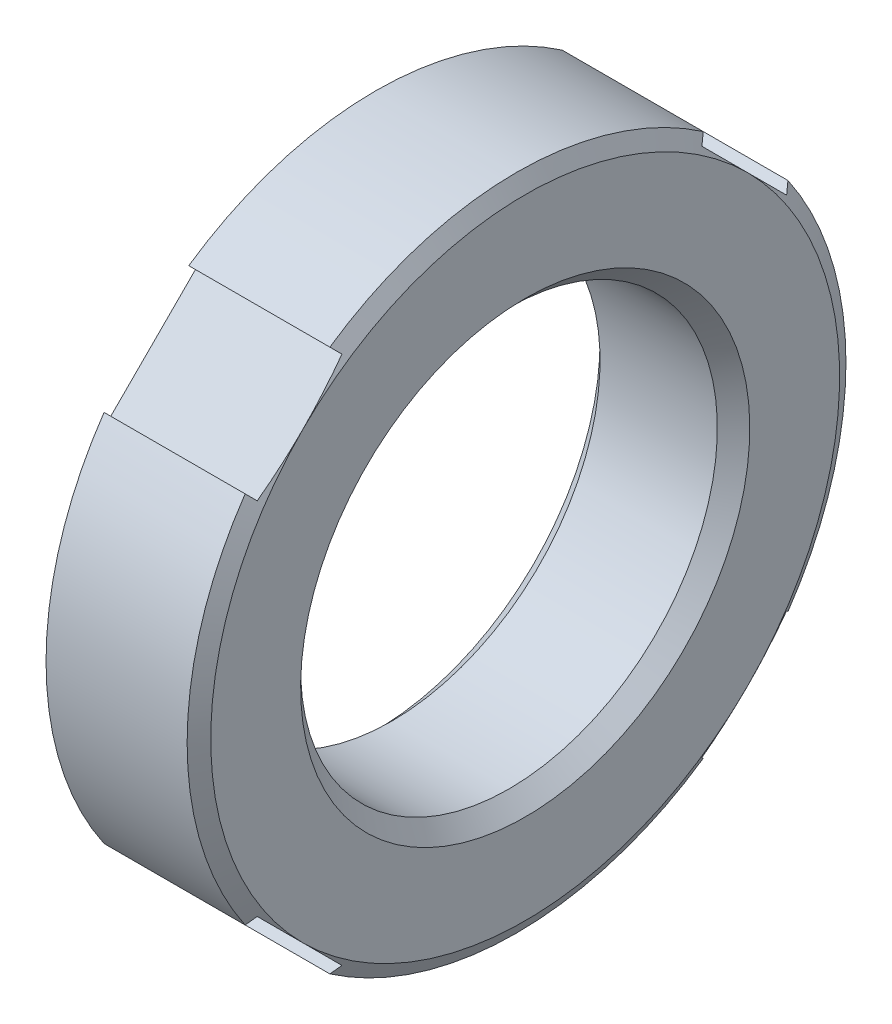
ISO-10303-21;
HEADER;
FILE_DESCRIPTION(('STEP AP214'),'2;1');
FILE_NAME('part.step','',(''),(''),'','','');
FILE_SCHEMA(('AUTOMOTIVE_DESIGN { 1 0 10303 214 1 1 1 1 }'));
ENDSEC;
DATA;
#1=APPLICATION_CONTEXT('core data for automotive mechanical design processes');
#2=APPLICATION_PROTOCOL_DEFINITION('international standard','automotive_design',2000,#1);
#3=PRODUCT_CONTEXT('',#1,'mechanical');
#4=PRODUCT('Part','Part','',(#3));
#5=PRODUCT_RELATED_PRODUCT_CATEGORY('part','',(#4));
#6=PRODUCT_DEFINITION_FORMATION('','',#4);
#7=PRODUCT_DEFINITION_CONTEXT('part definition',#1,'design');
#8=PRODUCT_DEFINITION('design','',#6,#7);
#9=PRODUCT_DEFINITION_SHAPE('','',#8);
#10=(LENGTH_UNIT() NAMED_UNIT(*) SI_UNIT(.MILLI.,.METRE.));
#11=(NAMED_UNIT(*) PLANE_ANGLE_UNIT() SI_UNIT($,.RADIAN.));
#12=(NAMED_UNIT(*) SI_UNIT($,.STERADIAN.) SOLID_ANGLE_UNIT());
#13=UNCERTAINTY_MEASURE_WITH_UNIT(LENGTH_MEASURE(1.E-05),#10,'distance_accuracy_value','');
#14=(GEOMETRIC_REPRESENTATION_CONTEXT(3) GLOBAL_UNCERTAINTY_ASSIGNED_CONTEXT((#13)) GLOBAL_UNIT_ASSIGNED_CONTEXT((#10,
#11,#12)) REPRESENTATION_CONTEXT('',''));
#15=CARTESIAN_POINT('',(0.,0.,0.));
#16=DIRECTION('',(0.,0.,1.));
#17=DIRECTION('',(1.,0.,0.));
#18=AXIS2_PLACEMENT_3D('',#15,#16,#17);
#19=CARTESIAN_POINT('',(2.5,-10.2530483272049,7.42462120245875));
#20=DIRECTION('',(0.,-0.707106781186547,-0.707106781186548));
#21=DIRECTION('',(1.,0.,0.));
#22=AXIS2_PLACEMENT_3D('',#19,#20,#21);
#23=PLANE('',#22);
#24=CARTESIAN_POINT('',(5.,-8.70290343092972,5.87447630618353));
#25=CARTESIAN_POINT('',(4.85913954199319,-8.87863895279117,6.05021182804498));
#26=CARTESIAN_POINT('',(4.71132486540519,-9.06274283276227,6.23431570801608));
#27=(BOUNDED_CURVE() B_SPLINE_CURVE(2,(#24,#25,#26),.UNSPECIFIED.,.F.,
.F.) B_SPLINE_CURVE_WITH_KNOTS((3,3),(0.,0.585065923235468),
.UNSPECIFIED.) CURVE() GEOMETRIC_REPRESENTATION_ITEM() RATIONAL_B_SPLINE_CURVE((1.,
1.00028023547212,1.)) REPRESENTATION_ITEM(''));
#28=CARTESIAN_POINT('',(4.89100829929986,-8.83883476483185,6.01040764008565));
#29=VERTEX_POINT('',#28);
#30=CARTESIAN_POINT('',(4.71132486540519,-9.06274283276227,6.23431570801608));
#31=VERTEX_POINT('',#30);
#32=EDGE_CURVE('E37',#29,#31,#27,.T.);
#33=ORIENTED_EDGE('',*,*,#32,.F.);
#34=DIRECTION('',(1.,0.,0.));
#35=VECTOR('',#34,1.);
#36=CARTESIAN_POINT('',(2.5,-8.83883476483185,6.01040764008565));
#37=LINE('',#36,#35);
#38=CARTESIAN_POINT('',(0.,-8.83883476483185,6.01040764008565));
#39=VERTEX_POINT('',#38);
#40=EDGE_CURVE('E28',#39,#29,#37,.T.);
#41=ORIENTED_EDGE('',*,*,#40,.F.);
#42=DIRECTION('',(0.,0.707106781186548,-0.707106781186548));
#43=VECTOR('',#42,1.);
#44=CARTESIAN_POINT('',(0.,-4.45863094478901,1.63020382004282));
#45=LINE('',#44,#43);
#46=CARTESIAN_POINT('',(0.,-9.06274283276227,6.23431570801608));
#47=VERTEX_POINT('',#46);
#48=EDGE_CURVE('E225',#47,#39,#45,.T.);
#49=ORIENTED_EDGE('',*,*,#48,.F.);
#50=DIRECTION('',(-1.,0.,0.));
#51=VECTOR('',#50,1.);
#52=CARTESIAN_POINT('',(2.3556624327026,-9.06274283276227,6.23431570801608));
#53=LINE('',#52,#51);
#54=EDGE_CURVE('E185',#31,#47,#53,.T.);
#55=ORIENTED_EDGE('',*,*,#54,.F.);
#56=EDGE_LOOP('',(#33,#41,#49,#55));
#57=FACE_BOUND('',#56,.T.);
#58=ADVANCED_FACE('F16',(#57),#23,.F.);
#59=CARTESIAN_POINT('',(2.5,-7.42462120245875,10.2530483272049));
#60=DIRECTION('',(0.,-0.707106781186547,-0.707106781186548));
#61=DIRECTION('',(1.,0.,0.));
#62=AXIS2_PLACEMENT_3D('',#59,#60,#61);
#63=PLANE('',#62);
#64=CARTESIAN_POINT('',(4.71132486540519,-6.23431570801609,9.06274283276227));
#65=CARTESIAN_POINT('',(4.85913954197738,-6.05021182806471,8.8786389528109));
#66=CARTESIAN_POINT('',(5.,-5.87447630618353,8.70290343092972));
#67=(BOUNDED_CURVE() B_SPLINE_CURVE(2,(#64,#65,#66),.UNSPECIFIED.,.F.,
.F.) B_SPLINE_CURVE_WITH_KNOTS((3,3),(0.,0.58506592323547),
.UNSPECIFIED.) CURVE() GEOMETRIC_REPRESENTATION_ITEM() RATIONAL_B_SPLINE_CURVE((1.,
1.000280235482,1.)) REPRESENTATION_ITEM(''));
#68=CARTESIAN_POINT('',(4.71132486540519,-6.23431570801609,9.06274283276227));
#69=VERTEX_POINT('',#68);
#70=CARTESIAN_POINT('',(4.89100829929987,-6.01040764008566,8.83883476483184));
#71=VERTEX_POINT('',#70);
#72=EDGE_CURVE('E171',#69,#71,#67,.T.);
#73=ORIENTED_EDGE('',*,*,#72,.F.);
#74=DIRECTION('',(1.,0.,0.));
#75=VECTOR('',#74,1.);
#76=CARTESIAN_POINT('',(2.3556624327026,-6.23431570801609,9.06274283276227));
#77=LINE('',#76,#75);
#78=CARTESIAN_POINT('',(0.,-6.23431570801609,9.06274283276227));
#79=VERTEX_POINT('',#78);
#80=EDGE_CURVE('E307',#79,#69,#77,.T.);
#81=ORIENTED_EDGE('',*,*,#80,.F.);
#82=DIRECTION('',(0.,-0.707106781186548,0.707106781186548));
#83=VECTOR('',#82,1.);
#84=CARTESIAN_POINT('',(0.,-1.63020382004282,4.45863094478901));
#85=LINE('',#84,#83);
#86=CARTESIAN_POINT('',(0.,-6.01040764008566,8.83883476483184));
#87=VERTEX_POINT('',#86);
#88=EDGE_CURVE('E206',#87,#79,#85,.T.);
#89=ORIENTED_EDGE('',*,*,#88,.F.);
#90=DIRECTION('',(-1.,0.,0.));
#91=VECTOR('',#90,1.);
#92=CARTESIAN_POINT('',(2.5,-6.01040764008566,8.83883476483184));
#93=LINE('',#92,#91);
#94=EDGE_CURVE('E11',#71,#87,#93,.T.);
#95=ORIENTED_EDGE('',*,*,#94,.F.);
#96=EDGE_LOOP('',(#73,#81,#89,#95));
#97=FACE_BOUND('',#96,.T.);
#98=ADVANCED_FACE('F410',(#97),#63,.T.);
#99=CARTESIAN_POINT('',(2.5,-7.42462120245875,7.42462120245875));
#100=DIRECTION('',(0.,-0.707106781186548,0.707106781186547));
#101=DIRECTION('',(0.,-0.707106781186548,-0.707106781186548));
#102=AXIS2_PLACEMENT_3D('',#99,#100,#101);
#103=PLANE('',#102);
#104=CARTESIAN_POINT('',(4.71132486540519,-5.10621657858482,9.74302582633268));
#105=CARTESIAN_POINT('',(5.,-6.29237708382266,8.55686532109483));
#106=CARTESIAN_POINT('',(5.,-7.42462120245875,7.42462120245875));
#107=CARTESIAN_POINT('',(5.,-8.55686532109484,6.29237708382265));
#108=CARTESIAN_POINT('',(4.71132486540519,-9.74302582633268,5.10621657858482));
#109=(BOUNDED_CURVE() B_SPLINE_CURVE(2,(#104,#105,#106,#107,#108),.UNSPECIFIED.,.F.,
.F.) B_SPLINE_CURVE_WITH_KNOTS((3,2,3),(0.,3.29443372163616,6.58886744327233),
.UNSPECIFIED.) CURVE() GEOMETRIC_REPRESENTATION_ITEM() RATIONAL_B_SPLINE_CURVE((1.,
1.01183473147029,1.,1.01183473147027,1.)) REPRESENTATION_ITEM(''));
#110=CARTESIAN_POINT('',(5.,-7.42462120245875,7.42462120245875));
#111=VERTEX_POINT('',#110);
#112=EDGE_CURVE('E292',#111,#29,#109,.T.);
#113=ORIENTED_EDGE('',*,*,#112,.F.);
#114=CARTESIAN_POINT('',(4.71132486540519,-5.10621657858482,9.74302582633268));
#115=CARTESIAN_POINT('',(5.,-6.29237708382266,8.55686532109483));
#116=CARTESIAN_POINT('',(5.,-7.42462120245875,7.42462120245875));
#117=CARTESIAN_POINT('',(5.,-8.55686532109484,6.29237708382265));
#118=CARTESIAN_POINT('',(4.71132486540519,-9.74302582633268,5.10621657858482));
#119=(BOUNDED_CURVE() B_SPLINE_CURVE(2,(#114,#115,#116,#117,#118),.UNSPECIFIED.,.F.,
.F.) B_SPLINE_CURVE_WITH_KNOTS((3,2,3),(0.,3.29443372163616,6.58886744327233),
.UNSPECIFIED.) CURVE() GEOMETRIC_REPRESENTATION_ITEM() RATIONAL_B_SPLINE_CURVE((1.,
1.01183473147029,1.,1.01183473147027,1.)) REPRESENTATION_ITEM(''));
#120=EDGE_CURVE('E293',#71,#111,#119,.T.);
#121=ORIENTED_EDGE('',*,*,#120,.F.);
#122=ORIENTED_EDGE('',*,*,#94,.T.);
#123=DIRECTION('',(0.,0.707106781186548,0.707106781186548));
#124=VECTOR('',#123,1.);
#125=CARTESIAN_POINT('',(0.,-6.04962120245875,8.79962120245875));
#126=LINE('',#125,#124);
#127=EDGE_CURVE('E212',#39,#87,#126,.T.);
#128=ORIENTED_EDGE('',*,*,#127,.F.);
#129=ORIENTED_EDGE('',*,*,#40,.T.);
#130=EDGE_LOOP('',(#113,#121,#122,#128,#129));
#131=FACE_BOUND('',#130,.T.);
#132=ADVANCED_FACE('F413',(#131),#103,.T.);
#133=CARTESIAN_POINT('',(4.8556624327026,0.,0.));
#134=DIRECTION('',(-1.,0.,0.));
#135=DIRECTION('',(0.,1.,0.));
#136=AXIS2_PLACEMENT_3D('',#133,#134,#135);
#137=CONICAL_SURFACE('',#136,10.75,1.0471975511966);
#138=ORIENTED_EDGE('',*,*,#112,.T.);
#139=ORIENTED_EDGE('',*,*,#32,.T.);
#140=CARTESIAN_POINT('',(4.71132486540519,0.,0.));
#141=DIRECTION('',(1.,0.,0.));
#142=DIRECTION('',(0.,1.,0.));
#143=AXIS2_PLACEMENT_3D('',#140,#141,#142);
#144=CIRCLE('',#143,11.);
#145=CARTESIAN_POINT('',(4.71132486540519,-9.06274283276227,-6.23431570801609));
#146=VERTEX_POINT('',#145);
#147=EDGE_CURVE('E205',#31,#146,#144,.T.);
#148=ORIENTED_EDGE('',*,*,#147,.T.);
#149=CARTESIAN_POINT('',(4.71132486540519,-9.06274283276227,-6.23431570801609));
#150=CARTESIAN_POINT('',(4.85913954199182,-8.87863895279288,-6.0502118280467));
#151=CARTESIAN_POINT('',(5.,-8.70290343092972,-5.87447630618353));
#152=(BOUNDED_CURVE() B_SPLINE_CURVE(2,(#149,#150,#151),.UNSPECIFIED.,.F.,
.F.) B_SPLINE_CURVE_WITH_KNOTS((3,3),(0.,0.585065923235466),
.UNSPECIFIED.) CURVE() GEOMETRIC_REPRESENTATION_ITEM() RATIONAL_B_SPLINE_CURVE((1.,
1.00028023548243,1.)) REPRESENTATION_ITEM(''));
#153=CARTESIAN_POINT('',(4.89100829929987,-8.83883476483184,-6.01040764008565));
#154=VERTEX_POINT('',#153);
#155=EDGE_CURVE('E201',#146,#154,#152,.T.);
#156=ORIENTED_EDGE('',*,*,#155,.T.);
#157=CARTESIAN_POINT('',(4.71132486540519,-9.74302582633268,-5.10621657858482));
#158=CARTESIAN_POINT('',(5.00000000000001,-8.55686532109486,-6.29237708382265));
#159=CARTESIAN_POINT('',(5.,-7.42462120245875,-7.42462120245875));
#160=CARTESIAN_POINT('',(5.00000000000001,-6.29237708382264,-8.55686532109487));
#161=CARTESIAN_POINT('',(4.71132486540519,-5.10621657858481,-9.74302582633268));
#162=(BOUNDED_CURVE() B_SPLINE_CURVE(2,(#157,#158,#159,#160,#161),.UNSPECIFIED.,.F.,
.F.) B_SPLINE_CURVE_WITH_KNOTS((3,2,3),(0.,3.29443372163617,6.58886744327234),
.UNSPECIFIED.) CURVE() GEOMETRIC_REPRESENTATION_ITEM() RATIONAL_B_SPLINE_CURVE((1.,
1.01183473147028,1.,1.01183473147025,1.)) REPRESENTATION_ITEM(''));
#163=CARTESIAN_POINT('',(5.,-7.42462120245875,-7.42462120245875));
#164=VERTEX_POINT('',#163);
#165=EDGE_CURVE('E98',#154,#164,#162,.T.);
#166=ORIENTED_EDGE('',*,*,#165,.T.);
#167=CARTESIAN_POINT('',(5.,0.,0.));
#168=DIRECTION('',(1.,0.,0.));
#169=DIRECTION('',(0.,1.,0.));
#170=AXIS2_PLACEMENT_3D('',#167,#168,#169);
#171=CIRCLE('',#170,10.5);
#172=EDGE_CURVE('E108',#111,#164,#171,.T.);
#173=ORIENTED_EDGE('',*,*,#172,.F.);
#174=EDGE_LOOP('',(#138,#139,#148,#156,#166,#173));
#175=FACE_BOUND('',#174,.T.);
#176=ADVANCED_FACE('F415',(#175),#137,.T.);
#177=CARTESIAN_POINT('',(0.,5.5,0.));
#178=DIRECTION('',(-1.,0.,0.));
#179=DIRECTION('',(0.,-1.,0.));
#180=AXIS2_PLACEMENT_3D('',#177,#178,#179);
#181=PLANE('',#180);
#182=CARTESIAN_POINT('',(0.,0.,0.));
#183=DIRECTION('',(1.,0.,0.));
#184=DIRECTION('',(0.,1.,0.));
#185=AXIS2_PLACEMENT_3D('',#182,#183,#184);
#186=CIRCLE('',#185,7.5);
#187=CARTESIAN_POINT('',(0.,7.5,0.));
#188=VERTEX_POINT('',#187);
#189=EDGE_CURVE('E180',#188,#188,#186,.T.);
#190=ORIENTED_EDGE('',*,*,#189,.T.);
#191=EDGE_LOOP('',(#190));
#192=FACE_BOUND('',#191,.T.);
#193=ORIENTED_EDGE('',*,*,#48,.T.);
#194=ORIENTED_EDGE('',*,*,#127,.T.);
#195=ORIENTED_EDGE('',*,*,#88,.T.);
#196=CARTESIAN_POINT('',(0.,0.,0.));
#197=DIRECTION('',(1.,0.,0.));
#198=DIRECTION('',(0.,1.,0.));
#199=AXIS2_PLACEMENT_3D('',#196,#197,#198);
#200=CIRCLE('',#199,11.);
#201=CARTESIAN_POINT('',(0.,6.23431570801608,9.06274283276227));
#202=VERTEX_POINT('',#201);
#203=EDGE_CURVE('E182',#202,#79,#200,.T.);
#204=ORIENTED_EDGE('',*,*,#203,.F.);
#205=DIRECTION('',(0.,-0.707106781186548,-0.707106781186548));
#206=VECTOR('',#205,1.);
#207=CARTESIAN_POINT('',(0.,4.38020382004283,7.20863094478902));
#208=LINE('',#207,#206);
#209=CARTESIAN_POINT('',(0.,6.01040764008565,8.83883476483184));
#210=VERTEX_POINT('',#209);
#211=EDGE_CURVE('E195',#202,#210,#208,.T.);
#212=ORIENTED_EDGE('',*,*,#211,.T.);
#213=DIRECTION('',(0.,0.707106781186548,-0.707106781186548));
#214=VECTOR('',#213,1.);
#215=CARTESIAN_POINT('',(0.,8.79962120245875,6.04962120245875));
#216=LINE('',#215,#214);
#217=CARTESIAN_POINT('',(0.,8.83883476483184,6.01040764008565));
#218=VERTEX_POINT('',#217);
#219=EDGE_CURVE('E189',#210,#218,#216,.T.);
#220=ORIENTED_EDGE('',*,*,#219,.T.);
#221=DIRECTION('',(0.,0.707106781186548,0.707106781186548));
#222=VECTOR('',#221,1.);
#223=CARTESIAN_POINT('',(0.,7.20863094478902,4.38020382004283));
#224=LINE('',#223,#222);
#225=CARTESIAN_POINT('',(0.,9.06274283276227,6.23431570801608));
#226=VERTEX_POINT('',#225);
#227=EDGE_CURVE('E196',#218,#226,#224,.T.);
#228=ORIENTED_EDGE('',*,*,#227,.T.);
#229=CARTESIAN_POINT('',(0.,0.,0.));
#230=DIRECTION('',(1.,0.,0.));
#231=DIRECTION('',(0.,1.,0.));
#232=AXIS2_PLACEMENT_3D('',#229,#230,#231);
#233=CIRCLE('',#232,11.);
#234=CARTESIAN_POINT('',(0.,9.06274283276227,-6.23431570801608));
#235=VERTEX_POINT('',#234);
#236=EDGE_CURVE('E217',#235,#226,#233,.T.);
#237=ORIENTED_EDGE('',*,*,#236,.F.);
#238=DIRECTION('',(0.,-0.707106781186548,0.707106781186548));
#239=VECTOR('',#238,1.);
#240=CARTESIAN_POINT('',(0.,7.20863094478902,-4.38020382004283));
#241=LINE('',#240,#239);
#242=CARTESIAN_POINT('',(0.,8.83883476483184,-6.01040764008565));
#243=VERTEX_POINT('',#242);
#244=EDGE_CURVE('E197',#235,#243,#241,.T.);
#245=ORIENTED_EDGE('',*,*,#244,.T.);
#246=DIRECTION('',(0.,-0.707106781186548,-0.707106781186548));
#247=VECTOR('',#246,1.);
#248=CARTESIAN_POINT('',(0.,8.79962120245875,-6.04962120245875));
#249=LINE('',#248,#247);
#250=CARTESIAN_POINT('',(0.,6.01040764008565,-8.83883476483184));
#251=VERTEX_POINT('',#250);
#252=EDGE_CURVE('E199',#243,#251,#249,.T.);
#253=ORIENTED_EDGE('',*,*,#252,.T.);
#254=DIRECTION('',(0.,0.707106781186548,-0.707106781186548));
#255=VECTOR('',#254,1.);
#256=CARTESIAN_POINT('',(0.,4.38020382004283,-7.20863094478902));
#257=LINE('',#256,#255);
#258=CARTESIAN_POINT('',(0.,6.23431570801608,-9.06274283276227));
#259=VERTEX_POINT('',#258);
#260=EDGE_CURVE('E244',#251,#259,#257,.T.);
#261=ORIENTED_EDGE('',*,*,#260,.T.);
#262=CARTESIAN_POINT('',(0.,0.,0.));
#263=DIRECTION('',(1.,0.,0.));
#264=DIRECTION('',(0.,1.,0.));
#265=AXIS2_PLACEMENT_3D('',#262,#263,#264);
#266=CIRCLE('',#265,11.);
#267=CARTESIAN_POINT('',(0.,-6.23431570801608,-9.06274283276227));
#268=VERTEX_POINT('',#267);
#269=EDGE_CURVE('E238',#268,#259,#266,.T.);
#270=ORIENTED_EDGE('',*,*,#269,.F.);
#271=DIRECTION('',(0.,0.707106781186548,0.707106781186548));
#272=VECTOR('',#271,1.);
#273=CARTESIAN_POINT('',(0.,-1.63020382004282,-4.45863094478901));
#274=LINE('',#273,#272);
#275=CARTESIAN_POINT('',(0.,-6.01040764008565,-8.83883476483184));
#276=VERTEX_POINT('',#275);
#277=EDGE_CURVE('E241',#268,#276,#274,.T.);
#278=ORIENTED_EDGE('',*,*,#277,.T.);
#279=DIRECTION('',(0.,-0.707106781186548,0.707106781186548));
#280=VECTOR('',#279,1.);
#281=CARTESIAN_POINT('',(0.,-6.04962120245875,-8.79962120245875));
#282=LINE('',#281,#280);
#283=CARTESIAN_POINT('',(0.,-8.83883476483184,-6.01040764008565));
#284=VERTEX_POINT('',#283);
#285=EDGE_CURVE('E245',#276,#284,#282,.T.);
#286=ORIENTED_EDGE('',*,*,#285,.T.);
#287=DIRECTION('',(0.,-0.707106781186548,-0.707106781186548));
#288=VECTOR('',#287,1.);
#289=CARTESIAN_POINT('',(0.,-4.45863094478901,-1.63020382004282));
#290=LINE('',#289,#288);
#291=CARTESIAN_POINT('',(0.,-9.06274283276227,-6.23431570801609));
#292=VERTEX_POINT('',#291);
#293=EDGE_CURVE('E337',#284,#292,#290,.T.);
#294=ORIENTED_EDGE('',*,*,#293,.T.);
#295=CARTESIAN_POINT('',(0.,0.,0.));
#296=DIRECTION('',(1.,0.,0.));
#297=DIRECTION('',(0.,1.,0.));
#298=AXIS2_PLACEMENT_3D('',#295,#296,#297);
#299=CIRCLE('',#298,11.);
#300=EDGE_CURVE('E235',#47,#292,#299,.T.);
#301=ORIENTED_EDGE('',*,*,#300,.F.);
#302=EDGE_LOOP('',(#193,#194,#195,#204,#212,#220,#228,#237,#245,#253,#261,#270,#278,#286,#294,#301));
#303=FACE_BOUND('',#302,.T.);
#304=ADVANCED_FACE('F402',(#192,#303),#181,.T.);
#305=CARTESIAN_POINT('',(2.3556624327026,0.,0.));
#306=DIRECTION('',(-1.,0.,0.));
#307=DIRECTION('',(0.,1.,0.));
#308=AXIS2_PLACEMENT_3D('',#305,#306,#307);
#309=CYLINDRICAL_SURFACE('',#308,11.);
#310=ORIENTED_EDGE('',*,*,#80,.T.);
#311=CARTESIAN_POINT('',(4.71132486540519,0.,0.));
#312=DIRECTION('',(1.,0.,0.));
#313=DIRECTION('',(0.,1.,0.));
#314=AXIS2_PLACEMENT_3D('',#311,#312,#313);
#315=CIRCLE('',#314,11.);
#316=CARTESIAN_POINT('',(4.71132486540519,6.23431570801608,9.06274283276227));
#317=VERTEX_POINT('',#316);
#318=EDGE_CURVE('E175',#317,#69,#315,.T.);
#319=ORIENTED_EDGE('',*,*,#318,.F.);
#320=DIRECTION('',(-1.,0.,0.));
#321=VECTOR('',#320,1.);
#322=CARTESIAN_POINT('',(2.3556624327026,6.23431570801608,9.06274283276227));
#323=LINE('',#322,#321);
#324=EDGE_CURVE('E184',#317,#202,#323,.T.);
#325=ORIENTED_EDGE('',*,*,#324,.T.);
#326=ORIENTED_EDGE('',*,*,#203,.T.);
#327=EDGE_LOOP('',(#310,#319,#325,#326));
#328=FACE_BOUND('',#327,.T.);
#329=ADVANCED_FACE('F407',(#328),#309,.T.);
#330=CARTESIAN_POINT('',(2.3556624327026,0.,0.));
#331=DIRECTION('',(-1.,0.,0.));
#332=DIRECTION('',(0.,1.,0.));
#333=AXIS2_PLACEMENT_3D('',#330,#331,#332);
#334=CYLINDRICAL_SURFACE('',#333,11.);
#335=ORIENTED_EDGE('',*,*,#54,.T.);
#336=ORIENTED_EDGE('',*,*,#300,.T.);
#337=DIRECTION('',(1.,0.,0.));
#338=VECTOR('',#337,1.);
#339=CARTESIAN_POINT('',(2.3556624327026,-9.06274283276227,-6.23431570801609));
#340=LINE('',#339,#338);
#341=EDGE_CURVE('E246',#292,#146,#340,.T.);
#342=ORIENTED_EDGE('',*,*,#341,.T.);
#343=ORIENTED_EDGE('',*,*,#147,.F.);
#344=EDGE_LOOP('',(#335,#336,#342,#343));
#345=FACE_BOUND('',#344,.T.);
#346=ADVANCED_FACE('F486',(#345),#334,.T.);
#347=CARTESIAN_POINT('',(2.5,-7.42462120245875,-10.2530483272049));
#348=DIRECTION('',(0.,0.707106781186548,-0.707106781186547));
#349=DIRECTION('',(1.,0.,0.));
#350=AXIS2_PLACEMENT_3D('',#347,#348,#349);
#351=PLANE('',#350);
#352=CARTESIAN_POINT('',(5.,-5.87447630618353,-8.70290343092972));
#353=CARTESIAN_POINT('',(4.8591395420085,-6.05021182802591,-8.8786389527721));
#354=CARTESIAN_POINT('',(4.71132486540519,-6.23431570801608,-9.06274283276227));
#355=(BOUNDED_CURVE() B_SPLINE_CURVE(2,(#352,#353,#354),.UNSPECIFIED.,.F.,
.F.) B_SPLINE_CURVE_WITH_KNOTS((3,3),(0.,0.585065923235467),
.UNSPECIFIED.) CURVE() GEOMETRIC_REPRESENTATION_ITEM() RATIONAL_B_SPLINE_CURVE((1.,
1.00028023548592,1.)) REPRESENTATION_ITEM(''));
#356=CARTESIAN_POINT('',(4.89100829929987,-6.01040764008565,-8.83883476483184));
#357=VERTEX_POINT('',#356);
#358=CARTESIAN_POINT('',(4.71132486540519,-6.23431570801608,-9.06274283276227));
#359=VERTEX_POINT('',#358);
#360=EDGE_CURVE('E124',#357,#359,#355,.T.);
#361=ORIENTED_EDGE('',*,*,#360,.F.);
#362=DIRECTION('',(1.,0.,0.));
#363=VECTOR('',#362,1.);
#364=CARTESIAN_POINT('',(2.5,-6.01040764008565,-8.83883476483184));
#365=LINE('',#364,#363);
#366=EDGE_CURVE('E269',#276,#357,#365,.T.);
#367=ORIENTED_EDGE('',*,*,#366,.F.);
#368=ORIENTED_EDGE('',*,*,#277,.F.);
#369=DIRECTION('',(-1.,0.,0.));
#370=VECTOR('',#369,1.);
#371=CARTESIAN_POINT('',(2.3556624327026,-6.23431570801608,-9.06274283276227));
#372=LINE('',#371,#370);
#373=EDGE_CURVE('E129',#359,#268,#372,.T.);
#374=ORIENTED_EDGE('',*,*,#373,.F.);
#375=EDGE_LOOP('',(#361,#367,#368,#374));
#376=FACE_BOUND('',#375,.T.);
#377=ADVANCED_FACE('F422',(#376),#351,.F.);
#378=CARTESIAN_POINT('',(2.5,-10.2530483272049,-7.42462120245875));
#379=DIRECTION('',(0.,0.707106781186548,-0.707106781186547));
#380=DIRECTION('',(1.,0.,0.));
#381=AXIS2_PLACEMENT_3D('',#378,#379,#380);
#382=PLANE('',#381);
#383=ORIENTED_EDGE('',*,*,#155,.F.);
#384=ORIENTED_EDGE('',*,*,#341,.F.);
#385=ORIENTED_EDGE('',*,*,#293,.F.);
#386=DIRECTION('',(-1.,0.,0.));
#387=VECTOR('',#386,1.);
#388=CARTESIAN_POINT('',(2.5,-8.83883476483184,-6.01040764008565));
#389=LINE('',#388,#387);
#390=EDGE_CURVE('E249',#154,#284,#389,.T.);
#391=ORIENTED_EDGE('',*,*,#390,.F.);
#392=EDGE_LOOP('',(#383,#384,#385,#391));
#393=FACE_BOUND('',#392,.T.);
#394=ADVANCED_FACE('F494',(#393),#382,.T.);
#395=CARTESIAN_POINT('',(2.5,-7.42462120245875,-7.42462120245875));
#396=DIRECTION('',(0.,-0.707106781186547,-0.707106781186548));
#397=DIRECTION('',(0.,0.707106781186548,-0.707106781186548));
#398=AXIS2_PLACEMENT_3D('',#395,#396,#397);
#399=PLANE('',#398);
#400=CARTESIAN_POINT('',(4.71132486540519,-9.74302582633268,-5.10621657858482));
#401=CARTESIAN_POINT('',(5.00000000000001,-8.55686532109486,-6.29237708382265));
#402=CARTESIAN_POINT('',(5.,-7.42462120245875,-7.42462120245875));
#403=CARTESIAN_POINT('',(5.00000000000001,-6.29237708382264,-8.55686532109487));
#404=CARTESIAN_POINT('',(4.71132486540519,-5.10621657858481,-9.74302582633268));
#405=(BOUNDED_CURVE() B_SPLINE_CURVE(2,(#400,#401,#402,#403,#404),.UNSPECIFIED.,.F.,
.F.) B_SPLINE_CURVE_WITH_KNOTS((3,2,3),(0.,3.29443372163617,6.58886744327234),
.UNSPECIFIED.) CURVE() GEOMETRIC_REPRESENTATION_ITEM() RATIONAL_B_SPLINE_CURVE((1.,
1.01183473147028,1.,1.01183473147025,1.)) REPRESENTATION_ITEM(''));
#406=EDGE_CURVE('E274',#164,#357,#405,.T.);
#407=ORIENTED_EDGE('',*,*,#406,.F.);
#408=ORIENTED_EDGE('',*,*,#165,.F.);
#409=ORIENTED_EDGE('',*,*,#390,.T.);
#410=ORIENTED_EDGE('',*,*,#285,.F.);
#411=ORIENTED_EDGE('',*,*,#366,.T.);
#412=EDGE_LOOP('',(#407,#408,#409,#410,#411));
#413=FACE_BOUND('',#412,.T.);
#414=ADVANCED_FACE('F420',(#413),#399,.T.);
#415=CARTESIAN_POINT('',(4.8556624327026,0.,0.));
#416=DIRECTION('',(-1.,0.,0.));
#417=DIRECTION('',(0.,1.,0.));
#418=AXIS2_PLACEMENT_3D('',#415,#416,#417);
#419=CONICAL_SURFACE('',#418,10.75,1.0471975511966);
#420=ORIENTED_EDGE('',*,*,#406,.T.);
#421=ORIENTED_EDGE('',*,*,#360,.T.);
#422=CARTESIAN_POINT('',(4.71132486540519,0.,0.));
#423=DIRECTION('',(1.,0.,0.));
#424=DIRECTION('',(0.,1.,0.));
#425=AXIS2_PLACEMENT_3D('',#422,#423,#424);
#426=CIRCLE('',#425,11.);
#427=CARTESIAN_POINT('',(4.71132486540519,6.23431570801608,-9.06274283276227));
#428=VERTEX_POINT('',#427);
#429=EDGE_CURVE('E262',#359,#428,#426,.T.);
#430=ORIENTED_EDGE('',*,*,#429,.T.);
#431=CARTESIAN_POINT('',(4.71132486540519,6.23431570801608,-9.06274283276227));
#432=CARTESIAN_POINT('',(4.8591395420061,6.05021182802891,-8.8786389527751));
#433=CARTESIAN_POINT('',(5.,5.87447630618353,-8.70290343092972));
#434=(BOUNDED_CURVE() B_SPLINE_CURVE(2,(#431,#432,#433),.UNSPECIFIED.,.F.,
.F.) B_SPLINE_CURVE_WITH_KNOTS((3,3),(0.,0.585065923235464),
.UNSPECIFIED.) CURVE() GEOMETRIC_REPRESENTATION_ITEM() RATIONAL_B_SPLINE_CURVE((1.,
1.00028023542368,1.)) REPRESENTATION_ITEM(''));
#435=CARTESIAN_POINT('',(4.89100829929987,6.01040764008565,-8.83883476483184));
#436=VERTEX_POINT('',#435);
#437=EDGE_CURVE('E256',#428,#436,#434,.T.);
#438=ORIENTED_EDGE('',*,*,#437,.T.);
#439=CARTESIAN_POINT('',(4.71132486540519,5.10621657858481,-9.74302582633268));
#440=CARTESIAN_POINT('',(5.,6.29237708382265,-8.55686532109483));
#441=CARTESIAN_POINT('',(5.,7.42462120245875,-7.42462120245875));
#442=CARTESIAN_POINT('',(5.,8.55686532109483,-6.29237708382265));
#443=CARTESIAN_POINT('',(4.71132486540519,9.74302582633268,-5.10621657858481));
#444=(BOUNDED_CURVE() B_SPLINE_CURVE(2,(#439,#440,#441,#442,#443),.UNSPECIFIED.,.F.,
.F.) B_SPLINE_CURVE_WITH_KNOTS((3,2,3),(0.,3.29443372163617,6.58886744327234),
.UNSPECIFIED.) CURVE() GEOMETRIC_REPRESENTATION_ITEM() RATIONAL_B_SPLINE_CURVE((1.,
1.01183473147028,1.,1.01183473147028,1.)) REPRESENTATION_ITEM(''));
#445=CARTESIAN_POINT('',(5.,7.42462120245875,-7.42462120245875));
#446=VERTEX_POINT('',#445);
#447=EDGE_CURVE('E252',#436,#446,#444,.T.);
#448=ORIENTED_EDGE('',*,*,#447,.T.);
#449=CARTESIAN_POINT('',(5.,0.,0.));
#450=DIRECTION('',(1.,0.,0.));
#451=DIRECTION('',(0.,1.,0.));
#452=AXIS2_PLACEMENT_3D('',#449,#450,#451);
#453=CIRCLE('',#452,10.5);
#454=EDGE_CURVE('E227',#164,#446,#453,.T.);
#455=ORIENTED_EDGE('',*,*,#454,.F.);
#456=EDGE_LOOP('',(#420,#421,#430,#438,#448,#455));
#457=FACE_BOUND('',#456,.T.);
#458=ADVANCED_FACE('F419',(#457),#419,.T.);
#459=CARTESIAN_POINT('',(2.3556624327026,0.,0.));
#460=DIRECTION('',(-1.,0.,0.));
#461=DIRECTION('',(0.,1.,0.));
#462=AXIS2_PLACEMENT_3D('',#459,#460,#461);
#463=CYLINDRICAL_SURFACE('',#462,11.);
#464=ORIENTED_EDGE('',*,*,#373,.T.);
#465=ORIENTED_EDGE('',*,*,#269,.T.);
#466=DIRECTION('',(1.,0.,0.));
#467=VECTOR('',#466,1.);
#468=CARTESIAN_POINT('',(2.3556624327026,6.23431570801608,-9.06274283276227));
#469=LINE('',#468,#467);
#470=EDGE_CURVE('E240',#259,#428,#469,.T.);
#471=ORIENTED_EDGE('',*,*,#470,.T.);
#472=ORIENTED_EDGE('',*,*,#429,.F.);
#473=EDGE_LOOP('',(#464,#465,#471,#472));
#474=FACE_BOUND('',#473,.T.);
#475=ADVANCED_FACE('F424',(#474),#463,.T.);
#476=CARTESIAN_POINT('',(2.5,10.2530483272049,-7.42462120245875));
#477=DIRECTION('',(0.,0.707106781186548,0.707106781186548));
#478=DIRECTION('',(1.,0.,0.));
#479=AXIS2_PLACEMENT_3D('',#476,#477,#478);
#480=PLANE('',#479);
#481=CARTESIAN_POINT('',(5.,8.70290343092972,-5.87447630618353));
#482=CARTESIAN_POINT('',(4.85913954200653,8.87863895277457,-6.05021182802838));
#483=CARTESIAN_POINT('',(4.71132486540519,9.06274283276227,-6.23431570801608));
#484=(BOUNDED_CURVE() B_SPLINE_CURVE(2,(#481,#482,#483),.UNSPECIFIED.,.F.,
.F.) B_SPLINE_CURVE_WITH_KNOTS((3,3),(0.,0.585065923235463),
.UNSPECIFIED.) CURVE() GEOMETRIC_REPRESENTATION_ITEM() RATIONAL_B_SPLINE_CURVE((1.,
1.00028023542617,1.)) REPRESENTATION_ITEM(''));
#485=CARTESIAN_POINT('',(4.89100829929987,8.83883476483184,-6.01040764008565));
#486=VERTEX_POINT('',#485);
#487=CARTESIAN_POINT('',(4.71132486540519,9.06274283276227,-6.23431570801608));
#488=VERTEX_POINT('',#487);
#489=EDGE_CURVE('E322',#486,#488,#484,.T.);
#490=ORIENTED_EDGE('',*,*,#489,.F.);
#491=DIRECTION('',(1.,0.,0.));
#492=VECTOR('',#491,1.);
#493=CARTESIAN_POINT('',(2.5,8.83883476483184,-6.01040764008565));
#494=LINE('',#493,#492);
#495=EDGE_CURVE('E373',#243,#486,#494,.T.);
#496=ORIENTED_EDGE('',*,*,#495,.F.);
#497=ORIENTED_EDGE('',*,*,#244,.F.);
#498=DIRECTION('',(-1.,0.,0.));
#499=VECTOR('',#498,1.);
#500=CARTESIAN_POINT('',(2.3556624327026,9.06274283276227,-6.23431570801608));
#501=LINE('',#500,#499);
#502=EDGE_CURVE('E213',#488,#235,#501,.T.);
#503=ORIENTED_EDGE('',*,*,#502,.F.);
#504=EDGE_LOOP('',(#490,#496,#497,#503));
#505=FACE_BOUND('',#504,.T.);
#506=ADVANCED_FACE('F446',(#505),#480,.F.);
#507=CARTESIAN_POINT('',(2.5,7.42462120245875,-10.2530483272049));
#508=DIRECTION('',(0.,0.707106781186548,0.707106781186548));
#509=DIRECTION('',(1.,0.,0.));
#510=AXIS2_PLACEMENT_3D('',#507,#508,#509);
#511=PLANE('',#510);
#512=ORIENTED_EDGE('',*,*,#437,.F.);
#513=ORIENTED_EDGE('',*,*,#470,.F.);
#514=ORIENTED_EDGE('',*,*,#260,.F.);
#515=DIRECTION('',(-1.,0.,0.));
#516=VECTOR('',#515,1.);
#517=CARTESIAN_POINT('',(2.5,6.01040764008565,-8.83883476483184));
#518=LINE('',#517,#516);
#519=EDGE_CURVE('E342',#436,#251,#518,.T.);
#520=ORIENTED_EDGE('',*,*,#519,.F.);
#521=EDGE_LOOP('',(#512,#513,#514,#520));
#522=FACE_BOUND('',#521,.T.);
#523=ADVANCED_FACE('F18',(#522),#511,.T.);
#524=CARTESIAN_POINT('',(2.5,7.42462120245875,-7.42462120245875));
#525=DIRECTION('',(0.,0.707106781186548,-0.707106781186548));
#526=DIRECTION('',(0.,0.707106781186548,0.707106781186548));
#527=AXIS2_PLACEMENT_3D('',#524,#525,#526);
#528=PLANE('',#527);
#529=CARTESIAN_POINT('',(4.71132486540519,5.10621657858481,-9.74302582633268));
#530=CARTESIAN_POINT('',(5.,6.29237708382265,-8.55686532109483));
#531=CARTESIAN_POINT('',(5.,7.42462120245875,-7.42462120245875));
#532=CARTESIAN_POINT('',(5.,8.55686532109483,-6.29237708382265));
#533=CARTESIAN_POINT('',(4.71132486540519,9.74302582633268,-5.10621657858481));
#534=(BOUNDED_CURVE() B_SPLINE_CURVE(2,(#529,#530,#531,#532,#533),.UNSPECIFIED.,.F.,
.F.) B_SPLINE_CURVE_WITH_KNOTS((3,2,3),(0.,3.29443372163617,6.58886744327234),
.UNSPECIFIED.) CURVE() GEOMETRIC_REPRESENTATION_ITEM() RATIONAL_B_SPLINE_CURVE((1.,
1.01183473147028,1.,1.01183473147028,1.)) REPRESENTATION_ITEM(''));
#535=EDGE_CURVE('E330',#446,#486,#534,.T.);
#536=ORIENTED_EDGE('',*,*,#535,.F.);
#537=ORIENTED_EDGE('',*,*,#447,.F.);
#538=ORIENTED_EDGE('',*,*,#519,.T.);
#539=ORIENTED_EDGE('',*,*,#252,.F.);
#540=ORIENTED_EDGE('',*,*,#495,.T.);
#541=EDGE_LOOP('',(#536,#537,#538,#539,#540));
#542=FACE_BOUND('',#541,.T.);
#543=ADVANCED_FACE('F428',(#542),#528,.T.);
#544=CARTESIAN_POINT('',(4.8556624327026,0.,0.));
#545=DIRECTION('',(-1.,0.,0.));
#546=DIRECTION('',(0.,1.,0.));
#547=AXIS2_PLACEMENT_3D('',#544,#545,#546);
#548=CONICAL_SURFACE('',#547,10.75,1.0471975511966);
#549=ORIENTED_EDGE('',*,*,#535,.T.);
#550=ORIENTED_EDGE('',*,*,#489,.T.);
#551=CARTESIAN_POINT('',(4.71132486540519,0.,0.));
#552=DIRECTION('',(1.,0.,0.));
#553=DIRECTION('',(0.,1.,0.));
#554=AXIS2_PLACEMENT_3D('',#551,#552,#553);
#555=CIRCLE('',#554,11.);
#556=CARTESIAN_POINT('',(4.71132486540519,9.06274283276227,6.23431570801608));
#557=VERTEX_POINT('',#556);
#558=EDGE_CURVE('E331',#488,#557,#555,.T.);
#559=ORIENTED_EDGE('',*,*,#558,.T.);
#560=CARTESIAN_POINT('',(4.71132486540519,9.06274283276227,6.23431570801608));
#561=CARTESIAN_POINT('',(4.85913954200601,8.87863895277522,6.05021182802903));
#562=CARTESIAN_POINT('',(5.,8.70290343092972,5.87447630618353));
#563=(BOUNDED_CURVE() B_SPLINE_CURVE(2,(#560,#561,#562),.UNSPECIFIED.,.F.,
.F.) B_SPLINE_CURVE_WITH_KNOTS((3,3),(0.,0.585065923235462),
.UNSPECIFIED.) CURVE() GEOMETRIC_REPRESENTATION_ITEM() RATIONAL_B_SPLINE_CURVE((1.,
1.00028023544293,1.)) REPRESENTATION_ITEM(''));
#564=CARTESIAN_POINT('',(4.89100829929987,8.83883476483184,6.01040764008565));
#565=VERTEX_POINT('',#564);
#566=EDGE_CURVE('E281',#557,#565,#563,.T.);
#567=ORIENTED_EDGE('',*,*,#566,.T.);
#568=CARTESIAN_POINT('',(4.71132486540519,9.74302582633268,5.10621657858481));
#569=CARTESIAN_POINT('',(5.00000000000001,8.55686532109485,6.29237708382265));
#570=CARTESIAN_POINT('',(5.,7.42462120245875,7.42462120245875));
#571=CARTESIAN_POINT('',(5.00000000000001,6.29237708382265,8.55686532109485));
#572=CARTESIAN_POINT('',(4.71132486540519,5.10621657858481,9.74302582633268));
#573=(BOUNDED_CURVE() B_SPLINE_CURVE(2,(#568,#569,#570,#571,#572),.UNSPECIFIED.,.F.,
.F.) B_SPLINE_CURVE_WITH_KNOTS((3,2,3),(0.,3.29443372163617,6.58886744327234),
.UNSPECIFIED.) CURVE() GEOMETRIC_REPRESENTATION_ITEM() RATIONAL_B_SPLINE_CURVE((1.,
1.01183473147029,1.,1.01183473147029,1.)) REPRESENTATION_ITEM(''));
#574=CARTESIAN_POINT('',(5.,7.42462120245875,7.42462120245875));
#575=VERTEX_POINT('',#574);
#576=EDGE_CURVE('E216',#565,#575,#573,.T.);
#577=ORIENTED_EDGE('',*,*,#576,.T.);
#578=CARTESIAN_POINT('',(5.,0.,0.));
#579=DIRECTION('',(1.,0.,0.));
#580=DIRECTION('',(0.,1.,0.));
#581=AXIS2_PLACEMENT_3D('',#578,#579,#580);
#582=CIRCLE('',#581,10.5);
#583=EDGE_CURVE('E251',#446,#575,#582,.T.);
#584=ORIENTED_EDGE('',*,*,#583,.F.);
#585=EDGE_LOOP('',(#549,#550,#559,#567,#577,#584));
#586=FACE_BOUND('',#585,.T.);
#587=ADVANCED_FACE('F395',(#586),#548,.T.);
#588=CARTESIAN_POINT('',(2.3556624327026,0.,0.));
#589=DIRECTION('',(-1.,0.,0.));
#590=DIRECTION('',(0.,1.,0.));
#591=AXIS2_PLACEMENT_3D('',#588,#589,#590);
#592=CYLINDRICAL_SURFACE('',#591,11.);
#593=ORIENTED_EDGE('',*,*,#502,.T.);
#594=ORIENTED_EDGE('',*,*,#236,.T.);
#595=DIRECTION('',(1.,0.,0.));
#596=VECTOR('',#595,1.);
#597=CARTESIAN_POINT('',(2.3556624327026,9.06274283276227,6.23431570801608));
#598=LINE('',#597,#596);
#599=EDGE_CURVE('E221',#226,#557,#598,.T.);
#600=ORIENTED_EDGE('',*,*,#599,.T.);
#601=ORIENTED_EDGE('',*,*,#558,.F.);
#602=EDGE_LOOP('',(#593,#594,#600,#601));
#603=FACE_BOUND('',#602,.T.);
#604=ADVANCED_FACE('F445',(#603),#592,.T.);
#605=CARTESIAN_POINT('',(2.5,7.42462120245875,10.2530483272049));
#606=DIRECTION('',(0.,-0.707106781186548,0.707106781186548));
#607=DIRECTION('',(1.,0.,0.));
#608=AXIS2_PLACEMENT_3D('',#605,#606,#607);
#609=PLANE('',#608);
#610=CARTESIAN_POINT('',(5.,5.87447630618353,8.70290343092972));
#611=CARTESIAN_POINT('',(4.85913954200557,6.05021182802956,8.87863895277576));
#612=CARTESIAN_POINT('',(4.71132486540519,6.23431570801608,9.06274283276227));
#613=(BOUNDED_CURVE() B_SPLINE_CURVE(2,(#610,#611,#612),.UNSPECIFIED.,.F.,
.F.) B_SPLINE_CURVE_WITH_KNOTS((3,3),(0.,0.585065923235463),
.UNSPECIFIED.) CURVE() GEOMETRIC_REPRESENTATION_ITEM() RATIONAL_B_SPLINE_CURVE((1.,
1.00028023542452,1.)) REPRESENTATION_ITEM(''));
#614=CARTESIAN_POINT('',(4.89100829929987,6.01040764008565,8.83883476483184));
#615=VERTEX_POINT('',#614);
#616=EDGE_CURVE('E20',#615,#317,#613,.T.);
#617=ORIENTED_EDGE('',*,*,#616,.F.);
#618=DIRECTION('',(1.,0.,0.));
#619=VECTOR('',#618,1.);
#620=CARTESIAN_POINT('',(2.5,6.01040764008565,8.83883476483184));
#621=LINE('',#620,#619);
#622=EDGE_CURVE('E222',#210,#615,#621,.T.);
#623=ORIENTED_EDGE('',*,*,#622,.F.);
#624=ORIENTED_EDGE('',*,*,#211,.F.);
#625=ORIENTED_EDGE('',*,*,#324,.F.);
#626=EDGE_LOOP('',(#617,#623,#624,#625));
#627=FACE_BOUND('',#626,.T.);
#628=ADVANCED_FACE('F404',(#627),#609,.F.);
#629=CARTESIAN_POINT('',(2.5,10.2530483272049,7.42462120245875));
#630=DIRECTION('',(0.,-0.707106781186548,0.707106781186548));
#631=DIRECTION('',(1.,0.,0.));
#632=AXIS2_PLACEMENT_3D('',#629,#630,#631);
#633=PLANE('',#632);
#634=ORIENTED_EDGE('',*,*,#566,.F.);
#635=ORIENTED_EDGE('',*,*,#599,.F.);
#636=ORIENTED_EDGE('',*,*,#227,.F.);
#637=DIRECTION('',(-1.,0.,0.));
#638=VECTOR('',#637,1.);
#639=CARTESIAN_POINT('',(2.5,8.83883476483184,6.01040764008565));
#640=LINE('',#639,#638);
#641=EDGE_CURVE('E218',#565,#218,#640,.T.);
#642=ORIENTED_EDGE('',*,*,#641,.F.);
#643=EDGE_LOOP('',(#634,#635,#636,#642));
#644=FACE_BOUND('',#643,.T.);
#645=ADVANCED_FACE('F399',(#644),#633,.T.);
#646=CARTESIAN_POINT('',(2.5,7.42462120245875,7.42462120245875));
#647=DIRECTION('',(0.,0.707106781186548,0.707106781186548));
#648=DIRECTION('',(0.,-0.707106781186548,0.707106781186548));
#649=AXIS2_PLACEMENT_3D('',#646,#647,#648);
#650=PLANE('',#649);
#651=CARTESIAN_POINT('',(4.71132486540519,9.74302582633268,5.10621657858481));
#652=CARTESIAN_POINT('',(5.00000000000001,8.55686532109485,6.29237708382265));
#653=CARTESIAN_POINT('',(5.,7.42462120245875,7.42462120245875));
#654=CARTESIAN_POINT('',(5.00000000000001,6.29237708382265,8.55686532109485));
#655=CARTESIAN_POINT('',(4.71132486540519,5.10621657858481,9.74302582633268));
#656=(BOUNDED_CURVE() B_SPLINE_CURVE(2,(#651,#652,#653,#654,#655),.UNSPECIFIED.,.F.,
.F.) B_SPLINE_CURVE_WITH_KNOTS((3,2,3),(0.,3.29443372163617,6.58886744327234),
.UNSPECIFIED.) CURVE() GEOMETRIC_REPRESENTATION_ITEM() RATIONAL_B_SPLINE_CURVE((1.,
1.01183473147029,1.,1.01183473147029,1.)) REPRESENTATION_ITEM(''));
#657=EDGE_CURVE('E301',#575,#615,#656,.T.);
#658=ORIENTED_EDGE('',*,*,#657,.F.);
#659=ORIENTED_EDGE('',*,*,#576,.F.);
#660=ORIENTED_EDGE('',*,*,#641,.T.);
#661=ORIENTED_EDGE('',*,*,#219,.F.);
#662=ORIENTED_EDGE('',*,*,#622,.T.);
#663=EDGE_LOOP('',(#658,#659,#660,#661,#662));
#664=FACE_BOUND('',#663,.T.);
#665=ADVANCED_FACE('F382',(#664),#650,.T.);
#666=CARTESIAN_POINT('',(0.270625,0.,0.));
#667=DIRECTION('',(-1.,0.,0.));
#668=DIRECTION('',(0.,1.,0.));
#669=AXIS2_PLACEMENT_3D('',#666,#667,#668);
#670=CONICAL_SURFACE('',#669,7.229375,0.785398163397448);
#671=CARTESIAN_POINT('',(0.54125,0.,0.));
#672=DIRECTION('',(1.,0.,0.));
#673=DIRECTION('',(0.,1.,0.));
#674=AXIS2_PLACEMENT_3D('',#671,#672,#673);
#675=CIRCLE('',#674,6.95875);
#676=CARTESIAN_POINT('',(0.54125,6.95875,0.));
#677=VERTEX_POINT('',#676);
#678=EDGE_CURVE('E230',#677,#677,#675,.T.);
#679=ORIENTED_EDGE('',*,*,#678,.T.);
#680=EDGE_LOOP('',(#679));
#681=FACE_BOUND('',#680,.T.);
#682=ORIENTED_EDGE('',*,*,#189,.F.);
#683=EDGE_LOOP('',(#682));
#684=FACE_BOUND('',#683,.T.);
#685=ADVANCED_FACE('F467',(#681,#684),#670,.F.);
#686=CARTESIAN_POINT('',(2.5,0.,0.));
#687=DIRECTION('',(-1.,0.,0.));
#688=DIRECTION('',(0.,1.,0.));
#689=AXIS2_PLACEMENT_3D('',#686,#687,#688);
#690=CYLINDRICAL_SURFACE('',#689,6.95875);
#691=CARTESIAN_POINT('',(4.45875,0.,0.));
#692=DIRECTION('',(1.,0.,0.));
#693=DIRECTION('',(0.,1.,0.));
#694=AXIS2_PLACEMENT_3D('',#691,#692,#693);
#695=CIRCLE('',#694,6.95875);
#696=CARTESIAN_POINT('',(4.45875,6.95875,0.));
#697=VERTEX_POINT('',#696);
#698=EDGE_CURVE('E233',#697,#697,#695,.T.);
#699=ORIENTED_EDGE('',*,*,#698,.T.);
#700=EDGE_LOOP('',(#699));
#701=FACE_BOUND('',#700,.T.);
#702=ORIENTED_EDGE('',*,*,#678,.F.);
#703=EDGE_LOOP('',(#702));
#704=FACE_BOUND('',#703,.T.);
#705=ADVANCED_FACE('F469',(#701,#704),#690,.F.);
#706=CARTESIAN_POINT('',(4.729375,0.,0.));
#707=DIRECTION('',(1.,0.,0.));
#708=DIRECTION('',(0.,1.,0.));
#709=AXIS2_PLACEMENT_3D('',#706,#707,#708);
#710=CONICAL_SURFACE('',#709,7.229375,0.785398163397448);
#711=CARTESIAN_POINT('',(5.,0.,0.));
#712=DIRECTION('',(-1.,0.,0.));
#713=DIRECTION('',(0.,1.,0.));
#714=AXIS2_PLACEMENT_3D('',#711,#712,#713);
#715=CIRCLE('',#714,7.5);
#716=CARTESIAN_POINT('',(5.,7.5,0.));
#717=VERTEX_POINT('',#716);
#718=EDGE_CURVE('E167',#717,#717,#715,.T.);
#719=ORIENTED_EDGE('',*,*,#718,.F.);
#720=EDGE_LOOP('',(#719));
#721=FACE_BOUND('',#720,.T.);
#722=ORIENTED_EDGE('',*,*,#698,.F.);
#723=EDGE_LOOP('',(#722));
#724=FACE_BOUND('',#723,.T.);
#725=ADVANCED_FACE('F168',(#721,#724),#710,.F.);
#726=CARTESIAN_POINT('',(4.8556624327026,0.,0.));
#727=DIRECTION('',(-1.,0.,0.));
#728=DIRECTION('',(0.,1.,0.));
#729=AXIS2_PLACEMENT_3D('',#726,#727,#728);
#730=CONICAL_SURFACE('',#729,10.75,1.0471975511966);
#731=ORIENTED_EDGE('',*,*,#120,.T.);
#732=CARTESIAN_POINT('',(5.,0.,0.));
#733=DIRECTION('',(1.,0.,0.));
#734=DIRECTION('',(0.,1.,0.));
#735=AXIS2_PLACEMENT_3D('',#732,#733,#734);
#736=CIRCLE('',#735,10.5);
#737=EDGE_CURVE('E172',#575,#111,#736,.T.);
#738=ORIENTED_EDGE('',*,*,#737,.F.);
#739=ORIENTED_EDGE('',*,*,#657,.T.);
#740=ORIENTED_EDGE('',*,*,#616,.T.);
#741=ORIENTED_EDGE('',*,*,#318,.T.);
#742=ORIENTED_EDGE('',*,*,#72,.T.);
#743=EDGE_LOOP('',(#731,#738,#739,#740,#741,#742));
#744=FACE_BOUND('',#743,.T.);
#745=ADVANCED_FACE('F389',(#744),#730,.T.);
#746=CARTESIAN_POINT('',(5.,5.25,0.));
#747=DIRECTION('',(1.,0.,0.));
#748=DIRECTION('',(0.,1.,0.));
#749=AXIS2_PLACEMENT_3D('',#746,#747,#748);
#750=PLANE('',#749);
#751=ORIENTED_EDGE('',*,*,#718,.T.);
#752=EDGE_LOOP('',(#751));
#753=FACE_BOUND('',#752,.T.);
#754=ORIENTED_EDGE('',*,*,#737,.T.);
#755=ORIENTED_EDGE('',*,*,#172,.T.);
#756=ORIENTED_EDGE('',*,*,#454,.T.);
#757=ORIENTED_EDGE('',*,*,#583,.T.);
#758=EDGE_LOOP('',(#754,#755,#756,#757));
#759=FACE_BOUND('',#758,.T.);
#760=ADVANCED_FACE('F392',(#753,#759),#750,.T.);
#761=CLOSED_SHELL('',(#58,#98,#132,#176,#304,#329,#346,#377,#394,#414,#458,#475,#506,#523,#543,
#587,#604,#628,#645,#665,#685,#705,#725,#745,#760));
#762=MANIFOLD_SOLID_BREP('B1',#761);
#763=ADVANCED_BREP_SHAPE_REPRESENTATION('',(#18,#762),#14);
#764=SHAPE_DEFINITION_REPRESENTATION(#9,#763);
ENDSEC;
END-ISO-10303-21;
